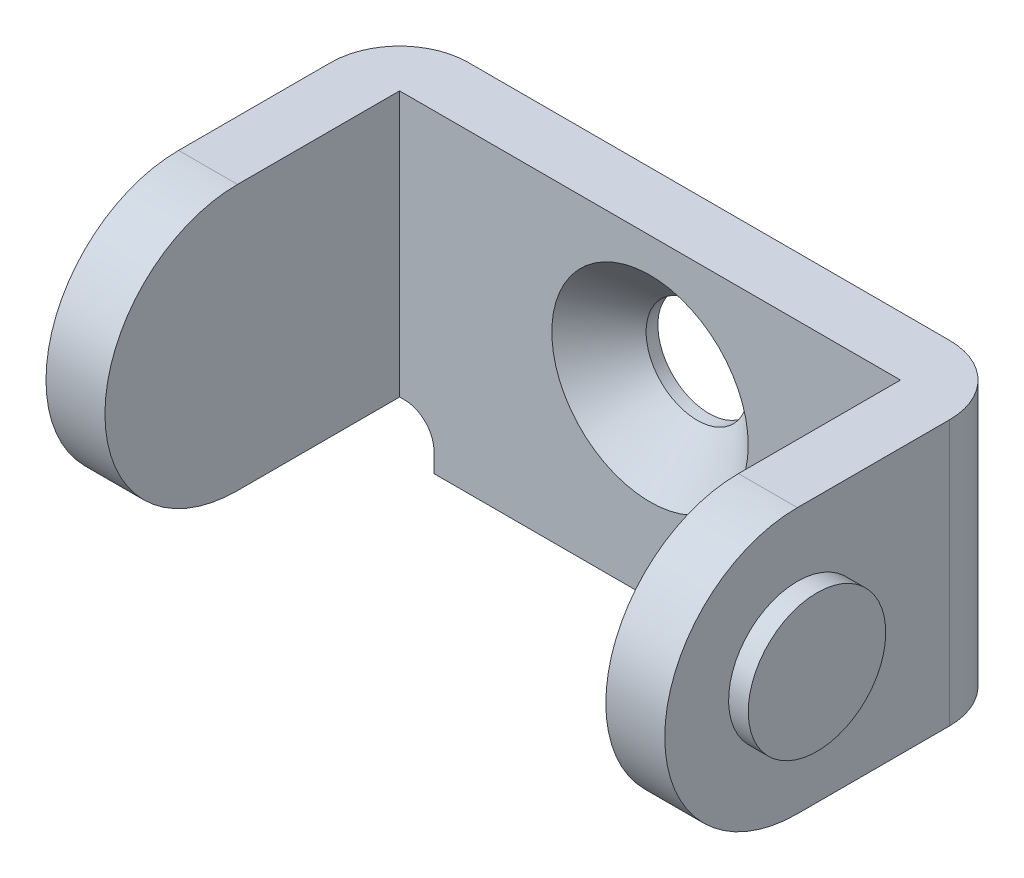
ISO-10303-21;
HEADER;
FILE_DESCRIPTION(('STEP AP214'),'2;1');
FILE_NAME('part.step','',(''),(''),'','','');
FILE_SCHEMA(('AUTOMOTIVE_DESIGN { 1 0 10303 214 1 1 1 1 }'));
ENDSEC;
DATA;
#1=APPLICATION_CONTEXT('core data for automotive mechanical design processes');
#2=APPLICATION_PROTOCOL_DEFINITION('international standard','automotive_design',2000,#1);
#3=PRODUCT_CONTEXT('',#1,'mechanical');
#4=PRODUCT('Part','Part','',(#3));
#5=PRODUCT_RELATED_PRODUCT_CATEGORY('part','',(#4));
#6=PRODUCT_DEFINITION_FORMATION('','',#4);
#7=PRODUCT_DEFINITION_CONTEXT('part definition',#1,'design');
#8=PRODUCT_DEFINITION('design','',#6,#7);
#9=PRODUCT_DEFINITION_SHAPE('','',#8);
#10=(LENGTH_UNIT() NAMED_UNIT(*) SI_UNIT(.MILLI.,.METRE.));
#11=(NAMED_UNIT(*) PLANE_ANGLE_UNIT() SI_UNIT($,.RADIAN.));
#12=(NAMED_UNIT(*) SI_UNIT($,.STERADIAN.) SOLID_ANGLE_UNIT());
#13=UNCERTAINTY_MEASURE_WITH_UNIT(LENGTH_MEASURE(1.E-05),#10,'distance_accuracy_value','');
#14=(GEOMETRIC_REPRESENTATION_CONTEXT(3) GLOBAL_UNCERTAINTY_ASSIGNED_CONTEXT((#13)) GLOBAL_UNIT_ASSIGNED_CONTEXT((#10,
#11,#12)) REPRESENTATION_CONTEXT('',''));
#15=CARTESIAN_POINT('',(0.,0.,0.));
#16=DIRECTION('',(0.,0.,1.));
#17=DIRECTION('',(1.,0.,0.));
#18=AXIS2_PLACEMENT_3D('',#15,#16,#17);
#19=CARTESIAN_POINT('',(-16.75,-6.74999999999999,11.25));
#20=DIRECTION('',(-1.,0.,0.));
#21=DIRECTION('',(0.,-1.,0.));
#22=AXIS2_PLACEMENT_3D('',#19,#20,#21);
#23=PLANE('',#22);
#24=CARTESIAN_POINT('',(-16.75,-6.74999999999999,11.25));
#25=DIRECTION('',(-1.,0.,0.));
#26=DIRECTION('',(0.,-1.,0.));
#27=AXIS2_PLACEMENT_3D('',#24,#25,#26);
#28=CIRCLE('',#27,3.5);
#29=CARTESIAN_POINT('',(-16.75,-10.25,11.25));
#30=VERTEX_POINT('',#29);
#31=EDGE_CURVE('E401',#30,#30,#28,.F.);
#32=ORIENTED_EDGE('',*,*,#31,.F.);
#33=EDGE_LOOP('',(#32));
#34=FACE_BOUND('',#33,.T.);
#35=ADVANCED_FACE('F35',(#34),#23,.T.);
#36=CARTESIAN_POINT('',(16.75,-6.74999999999999,11.25));
#37=DIRECTION('',(1.,0.,0.));
#38=DIRECTION('',(0.,1.,0.));
#39=AXIS2_PLACEMENT_3D('',#36,#37,#38);
#40=PLANE('',#39);
#41=CARTESIAN_POINT('',(16.75,-6.74999999999999,11.25));
#42=DIRECTION('',(1.,0.,0.));
#43=DIRECTION('',(0.,1.,0.));
#44=AXIS2_PLACEMENT_3D('',#41,#42,#43);
#45=CIRCLE('',#44,3.5);
#46=CARTESIAN_POINT('',(16.75,-3.24999999999999,11.25));
#47=VERTEX_POINT('',#46);
#48=EDGE_CURVE('E398',#47,#47,#45,.F.);
#49=ORIENTED_EDGE('',*,*,#48,.F.);
#50=EDGE_LOOP('',(#49));
#51=FACE_BOUND('',#50,.T.);
#52=ADVANCED_FACE('F325',(#51),#40,.T.);
#53=CARTESIAN_POINT('',(-15.75,-6.74999999999999,11.25));
#54=DIRECTION('',(-1.,0.,0.));
#55=DIRECTION('',(0.,-1.,0.));
#56=AXIS2_PLACEMENT_3D('',#53,#54,#55);
#57=CYLINDRICAL_SURFACE('',#56,3.5);
#58=ORIENTED_EDGE('',*,*,#31,.T.);
#59=EDGE_LOOP('',(#58));
#60=FACE_BOUND('',#59,.T.);
#61=CARTESIAN_POINT('',(-15.75,-6.74999999999999,11.25));
#62=DIRECTION('',(-1.,0.,0.));
#63=DIRECTION('',(0.,-1.,0.));
#64=AXIS2_PLACEMENT_3D('',#61,#62,#63);
#65=CIRCLE('',#64,3.5);
#66=CARTESIAN_POINT('',(-15.75,-10.25,11.25));
#67=VERTEX_POINT('',#66);
#68=EDGE_CURVE('E395',#67,#67,#65,.F.);
#69=ORIENTED_EDGE('',*,*,#68,.F.);
#70=EDGE_LOOP('',(#69));
#71=FACE_BOUND('',#70,.T.);
#72=ADVANCED_FACE('F329',(#60,#71),#57,.T.);
#73=CARTESIAN_POINT('',(15.75,-6.74999999999999,11.25));
#74=DIRECTION('',(1.,0.,0.));
#75=DIRECTION('',(0.,1.,0.));
#76=AXIS2_PLACEMENT_3D('',#73,#74,#75);
#77=CYLINDRICAL_SURFACE('',#76,3.5);
#78=ORIENTED_EDGE('',*,*,#48,.T.);
#79=EDGE_LOOP('',(#78));
#80=FACE_BOUND('',#79,.T.);
#81=CARTESIAN_POINT('',(15.75,-6.74999999999999,11.25));
#82=DIRECTION('',(1.,0.,0.));
#83=DIRECTION('',(0.,1.,0.));
#84=AXIS2_PLACEMENT_3D('',#81,#82,#83);
#85=CIRCLE('',#84,3.5);
#86=CARTESIAN_POINT('',(15.75,-3.24999999999999,11.25));
#87=VERTEX_POINT('',#86);
#88=EDGE_CURVE('E385',#87,#87,#85,.F.);
#89=ORIENTED_EDGE('',*,*,#88,.F.);
#90=EDGE_LOOP('',(#89));
#91=FACE_BOUND('',#90,.T.);
#92=ADVANCED_FACE('F333',(#80,#91),#77,.T.);
#93=CARTESIAN_POINT('',(-15.75,-13.5,0.));
#94=DIRECTION('',(-1.,0.,0.));
#95=DIRECTION('',(0.,-1.,0.));
#96=AXIS2_PLACEMENT_3D('',#93,#94,#95);
#97=PLANE('',#96);
#98=ORIENTED_EDGE('',*,*,#68,.T.);
#99=EDGE_LOOP('',(#98));
#100=FACE_BOUND('',#99,.T.);
#101=CARTESIAN_POINT('',(-15.75,-6.74999999999998,11.25));
#102=DIRECTION('',(1.,0.,0.));
#103=DIRECTION('',(0.,0.,-1.));
#104=AXIS2_PLACEMENT_3D('',#101,#102,#103);
#105=CIRCLE('',#104,6.75000000000002);
#106=CARTESIAN_POINT('',(-15.75,0.,11.25));
#107=VERTEX_POINT('',#106);
#108=CARTESIAN_POINT('',(-15.75,-13.5,11.25));
#109=VERTEX_POINT('',#108);
#110=EDGE_CURVE('E393',#107,#109,#105,.T.);
#111=ORIENTED_EDGE('',*,*,#110,.F.);
#112=DIRECTION('',(0.,0.,1.));
#113=VECTOR('',#112,1.);
#114=CARTESIAN_POINT('',(-15.75,0.,0.));
#115=LINE('',#114,#113);
#116=CARTESIAN_POINT('',(-15.75,0.,3.5));
#117=VERTEX_POINT('',#116);
#118=EDGE_CURVE('E210',#117,#107,#115,.T.);
#119=ORIENTED_EDGE('',*,*,#118,.F.);
#120=DIRECTION('',(0.,1.,0.));
#121=VECTOR('',#120,1.);
#122=CARTESIAN_POINT('',(-15.75,-17.1841485679075,3.5));
#123=LINE('',#122,#121);
#124=CARTESIAN_POINT('',(-15.75,-13.5,3.5));
#125=VERTEX_POINT('',#124);
#126=EDGE_CURVE('E245',#125,#117,#123,.T.);
#127=ORIENTED_EDGE('',*,*,#126,.F.);
#128=DIRECTION('',(0.,0.,1.));
#129=VECTOR('',#128,1.);
#130=CARTESIAN_POINT('',(-15.75,-13.5,0.));
#131=LINE('',#130,#129);
#132=EDGE_CURVE('E163',#109,#125,#131,.F.);
#133=ORIENTED_EDGE('',*,*,#132,.F.);
#134=EDGE_LOOP('',(#111,#119,#127,#133));
#135=FACE_BOUND('',#134,.T.);
#136=ADVANCED_FACE('F321',(#100,#135),#97,.T.);
#137=CARTESIAN_POINT('',(-15.7500000000001,-6.74999999999998,11.25));
#138=DIRECTION('',(1.,0.,0.));
#139=DIRECTION('',(0.,0.,-1.));
#140=AXIS2_PLACEMENT_3D('',#137,#138,#139);
#141=CYLINDRICAL_SURFACE('',#140,6.75000000000002);
#142=ORIENTED_EDGE('',*,*,#110,.T.);
#143=DIRECTION('',(1.,0.,0.));
#144=VECTOR('',#143,1.);
#145=CARTESIAN_POINT('',(-11.,-13.5,11.25));
#146=LINE('',#145,#144);
#147=CARTESIAN_POINT('',(-12.75,-13.5,11.25));
#148=VERTEX_POINT('',#147);
#149=EDGE_CURVE('E220',#148,#109,#146,.F.);
#150=ORIENTED_EDGE('',*,*,#149,.F.);
#151=CARTESIAN_POINT('',(-12.75,-6.74999999999998,11.25));
#152=DIRECTION('',(1.,0.,0.));
#153=DIRECTION('',(0.,0.,-1.));
#154=AXIS2_PLACEMENT_3D('',#151,#152,#153);
#155=CIRCLE('',#154,6.75000000000002);
#156=CARTESIAN_POINT('',(-12.75,0.,11.25));
#157=VERTEX_POINT('',#156);
#158=EDGE_CURVE('E391',#157,#148,#155,.T.);
#159=ORIENTED_EDGE('',*,*,#158,.F.);
#160=DIRECTION('',(-1.,0.,0.));
#161=VECTOR('',#160,1.);
#162=CARTESIAN_POINT('',(-15.75,0.,11.25));
#163=LINE('',#162,#161);
#164=EDGE_CURVE('E209',#107,#157,#163,.F.);
#165=ORIENTED_EDGE('',*,*,#164,.F.);
#166=EDGE_LOOP('',(#142,#150,#159,#165));
#167=FACE_BOUND('',#166,.T.);
#168=ADVANCED_FACE('F317',(#167),#141,.T.);
#169=CARTESIAN_POINT('',(-12.75,0.,3.));
#170=DIRECTION('',(1.,0.,0.));
#171=DIRECTION('',(0.,1.,0.));
#172=AXIS2_PLACEMENT_3D('',#169,#170,#171);
#173=PLANE('',#172);
#174=ORIENTED_EDGE('',*,*,#158,.T.);
#175=DIRECTION('',(0.,0.,1.));
#176=VECTOR('',#175,1.);
#177=CARTESIAN_POINT('',(-12.75,-13.5,0.));
#178=LINE('',#177,#176);
#179=CARTESIAN_POINT('',(-12.75,-13.5,3.));
#180=VERTEX_POINT('',#179);
#181=EDGE_CURVE('E224',#180,#148,#178,.T.);
#182=ORIENTED_EDGE('',*,*,#181,.F.);
#183=DIRECTION('',(0.,1.,0.));
#184=VECTOR('',#183,1.);
#185=CARTESIAN_POINT('',(-12.75,-71.7267259098514,3.));
#186=LINE('',#185,#184);
#187=CARTESIAN_POINT('',(-12.75,0.,3.));
#188=VERTEX_POINT('',#187);
#189=EDGE_CURVE('E409',#180,#188,#186,.T.);
#190=ORIENTED_EDGE('',*,*,#189,.T.);
#191=DIRECTION('',(0.,0.,1.));
#192=VECTOR('',#191,1.);
#193=CARTESIAN_POINT('',(-12.75,0.,0.));
#194=LINE('',#193,#192);
#195=EDGE_CURVE('E207',#157,#188,#194,.F.);
#196=ORIENTED_EDGE('',*,*,#195,.F.);
#197=EDGE_LOOP('',(#174,#182,#190,#196));
#198=FACE_BOUND('',#197,.T.);
#199=ADVANCED_FACE('F320',(#198),#173,.T.);
#200=CARTESIAN_POINT('',(12.75,-13.5,3.));
#201=DIRECTION('',(-1.,0.,0.));
#202=DIRECTION('',(0.,-1.,0.));
#203=AXIS2_PLACEMENT_3D('',#200,#201,#202);
#204=PLANE('',#203);
#205=CARTESIAN_POINT('',(12.75,-6.74999999999999,11.25));
#206=DIRECTION('',(1.,0.,0.));
#207=DIRECTION('',(0.,0.,-1.));
#208=AXIS2_PLACEMENT_3D('',#205,#206,#207);
#209=CIRCLE('',#208,6.75000000000001);
#210=CARTESIAN_POINT('',(12.75,0.,11.25));
#211=VERTEX_POINT('',#210);
#212=CARTESIAN_POINT('',(12.75,-13.5,11.25));
#213=VERTEX_POINT('',#212);
#214=EDGE_CURVE('E388',#211,#213,#209,.T.);
#215=ORIENTED_EDGE('',*,*,#214,.F.);
#216=DIRECTION('',(0.,0.,1.));
#217=VECTOR('',#216,1.);
#218=CARTESIAN_POINT('',(12.75,0.,0.));
#219=LINE('',#218,#217);
#220=CARTESIAN_POINT('',(12.75,0.,3.));
#221=VERTEX_POINT('',#220);
#222=EDGE_CURVE('E201',#221,#211,#219,.T.);
#223=ORIENTED_EDGE('',*,*,#222,.F.);
#224=DIRECTION('',(0.,1.,0.));
#225=VECTOR('',#224,1.);
#226=CARTESIAN_POINT('',(12.75,-71.7267259098514,3.));
#227=LINE('',#226,#225);
#228=CARTESIAN_POINT('',(12.75,-13.5,3.));
#229=VERTEX_POINT('',#228);
#230=EDGE_CURVE('E410',#229,#221,#227,.T.);
#231=ORIENTED_EDGE('',*,*,#230,.F.);
#232=DIRECTION('',(0.,0.,1.));
#233=VECTOR('',#232,1.);
#234=CARTESIAN_POINT('',(12.75,-13.5,0.));
#235=LINE('',#234,#233);
#236=EDGE_CURVE('E227',#213,#229,#235,.F.);
#237=ORIENTED_EDGE('',*,*,#236,.F.);
#238=EDGE_LOOP('',(#215,#223,#231,#237));
#239=FACE_BOUND('',#238,.T.);
#240=ADVANCED_FACE('F315',(#239),#204,.T.);
#241=CARTESIAN_POINT('',(12.75,-6.74999999999999,11.25));
#242=DIRECTION('',(1.,0.,0.));
#243=DIRECTION('',(0.,0.,-1.));
#244=AXIS2_PLACEMENT_3D('',#241,#242,#243);
#245=CYLINDRICAL_SURFACE('',#244,6.75000000000001);
#246=ORIENTED_EDGE('',*,*,#214,.T.);
#247=DIRECTION('',(1.,0.,0.));
#248=VECTOR('',#247,1.);
#249=CARTESIAN_POINT('',(15.75,-13.5,11.25));
#250=LINE('',#249,#248);
#251=CARTESIAN_POINT('',(15.75,-13.5,11.25));
#252=VERTEX_POINT('',#251);
#253=EDGE_CURVE('E164',#252,#213,#250,.F.);
#254=ORIENTED_EDGE('',*,*,#253,.F.);
#255=CARTESIAN_POINT('',(15.75,-6.74999999999999,11.25));
#256=DIRECTION('',(1.,0.,0.));
#257=DIRECTION('',(0.,0.,-1.));
#258=AXIS2_PLACEMENT_3D('',#255,#256,#257);
#259=CIRCLE('',#258,6.75000000000001);
#260=CARTESIAN_POINT('',(15.75,0.,11.25));
#261=VERTEX_POINT('',#260);
#262=EDGE_CURVE('E230',#261,#252,#259,.T.);
#263=ORIENTED_EDGE('',*,*,#262,.F.);
#264=DIRECTION('',(-1.,0.,0.));
#265=VECTOR('',#264,1.);
#266=CARTESIAN_POINT('',(-15.75,0.,11.25));
#267=LINE('',#266,#265);
#268=EDGE_CURVE('E200',#211,#261,#267,.F.);
#269=ORIENTED_EDGE('',*,*,#268,.F.);
#270=EDGE_LOOP('',(#246,#254,#263,#269));
#271=FACE_BOUND('',#270,.T.);
#272=ADVANCED_FACE('F311',(#271),#245,.T.);
#273=CARTESIAN_POINT('',(15.75,0.,0.));
#274=DIRECTION('',(1.,0.,0.));
#275=DIRECTION('',(0.,1.,0.));
#276=AXIS2_PLACEMENT_3D('',#273,#274,#275);
#277=PLANE('',#276);
#278=ORIENTED_EDGE('',*,*,#88,.T.);
#279=EDGE_LOOP('',(#278));
#280=FACE_BOUND('',#279,.T.);
#281=ORIENTED_EDGE('',*,*,#262,.T.);
#282=DIRECTION('',(0.,0.,1.));
#283=VECTOR('',#282,1.);
#284=CARTESIAN_POINT('',(15.75,-13.5,0.));
#285=LINE('',#284,#283);
#286=CARTESIAN_POINT('',(15.75,-13.5,3.5));
#287=VERTEX_POINT('',#286);
#288=EDGE_CURVE('E229',#287,#252,#285,.T.);
#289=ORIENTED_EDGE('',*,*,#288,.F.);
#290=DIRECTION('',(0.,-1.,0.));
#291=VECTOR('',#290,1.);
#292=CARTESIAN_POINT('',(15.75,-10.4341485679075,3.5));
#293=LINE('',#292,#291);
#294=CARTESIAN_POINT('',(15.75,0.,3.5));
#295=VERTEX_POINT('',#294);
#296=EDGE_CURVE('E238',#295,#287,#293,.T.);
#297=ORIENTED_EDGE('',*,*,#296,.F.);
#298=DIRECTION('',(0.,0.,1.));
#299=VECTOR('',#298,1.);
#300=CARTESIAN_POINT('',(15.75,0.,0.));
#301=LINE('',#300,#299);
#302=EDGE_CURVE('E197',#261,#295,#301,.F.);
#303=ORIENTED_EDGE('',*,*,#302,.F.);
#304=EDGE_LOOP('',(#281,#289,#297,#303));
#305=FACE_BOUND('',#304,.T.);
#306=ADVANCED_FACE('F314',(#280,#305),#277,.T.);
#307=CARTESIAN_POINT('',(15.75,-13.5,0.));
#308=DIRECTION('',(0.,-1.,0.));
#309=DIRECTION('',(1.,0.,0.));
#310=AXIS2_PLACEMENT_3D('',#307,#308,#309);
#311=PLANE('',#310);
#312=ORIENTED_EDGE('',*,*,#236,.T.);
#313=DIRECTION('',(1.,0.,0.));
#314=VECTOR('',#313,1.);
#315=CARTESIAN_POINT('',(15.75,-13.5,3.));
#316=LINE('',#315,#314);
#317=CARTESIAN_POINT('',(12.5,-13.5,3.));
#318=VERTEX_POINT('',#317);
#319=EDGE_CURVE('E404',#318,#229,#316,.T.);
#320=ORIENTED_EDGE('',*,*,#319,.F.);
#321=DIRECTION('',(0.,0.,1.));
#322=VECTOR('',#321,1.);
#323=CARTESIAN_POINT('',(12.5,-13.5,1.53349364905391));
#324=LINE('',#323,#322);
#325=CARTESIAN_POINT('',(12.5,-13.5,0.00893998905776507));
#326=VERTEX_POINT('',#325);
#327=EDGE_CURVE('E233',#326,#318,#324,.T.);
#328=ORIENTED_EDGE('',*,*,#327,.F.);
#329=CARTESIAN_POINT('',(12.25,-13.5,3.5));
#330=DIRECTION('',(0.,-1.,0.));
#331=DIRECTION('',(0.,0.,-1.));
#332=AXIS2_PLACEMENT_3D('',#329,#330,#331);
#333=CIRCLE('',#332,3.5);
#334=EDGE_CURVE('E237',#287,#326,#333,.F.);
#335=ORIENTED_EDGE('',*,*,#334,.F.);
#336=ORIENTED_EDGE('',*,*,#288,.T.);
#337=ORIENTED_EDGE('',*,*,#253,.T.);
#338=EDGE_LOOP('',(#312,#320,#328,#335,#336,#337));
#339=FACE_BOUND('',#338,.T.);
#340=ADVANCED_FACE('F349',(#339),#311,.T.);
#341=CARTESIAN_POINT('',(11.,-13.5,0.));
#342=DIRECTION('',(1.,0.,0.));
#343=DIRECTION('',(0.,1.,0.));
#344=AXIS2_PLACEMENT_3D('',#341,#342,#343);
#345=PLANE('',#344);
#346=DIRECTION('',(0.,0.,-1.));
#347=VECTOR('',#346,1.);
#348=CARTESIAN_POINT('',(11.,-15.,1.53349364905391));
#349=LINE('',#348,#347);
#350=CARTESIAN_POINT('',(11.,-15.,3.));
#351=VERTEX_POINT('',#350);
#352=CARTESIAN_POINT('',(11.,-15.,0.));
#353=VERTEX_POINT('',#352);
#354=EDGE_CURVE('E174',#351,#353,#349,.T.);
#355=ORIENTED_EDGE('',*,*,#354,.F.);
#356=DIRECTION('',(0.,1.,0.));
#357=VECTOR('',#356,1.);
#358=CARTESIAN_POINT('',(11.,-20.8682971358151,3.));
#359=LINE('',#358,#357);
#360=CARTESIAN_POINT('',(11.,-16.,3.));
#361=VERTEX_POINT('',#360);
#362=EDGE_CURVE('E168',#361,#351,#359,.T.);
#363=ORIENTED_EDGE('',*,*,#362,.F.);
#364=DIRECTION('',(0.,0.,1.));
#365=VECTOR('',#364,1.);
#366=CARTESIAN_POINT('',(11.,-16.,1.5));
#367=LINE('',#366,#365);
#368=CARTESIAN_POINT('',(11.,-16.,0.));
#369=VERTEX_POINT('',#368);
#370=EDGE_CURVE('E151',#369,#361,#367,.T.);
#371=ORIENTED_EDGE('',*,*,#370,.F.);
#372=DIRECTION('',(0.,1.,0.));
#373=VECTOR('',#372,1.);
#374=CARTESIAN_POINT('',(11.,-13.5,0.));
#375=LINE('',#374,#373);
#376=EDGE_CURVE('E156',#369,#353,#375,.T.);
#377=ORIENTED_EDGE('',*,*,#376,.T.);
#378=EDGE_LOOP('',(#355,#363,#371,#377));
#379=FACE_BOUND('',#378,.T.);
#380=ADVANCED_FACE('F167',(#379),#345,.T.);
#381=CARTESIAN_POINT('',(-11.,-13.5,0.));
#382=DIRECTION('',(0.,-1.,0.));
#383=DIRECTION('',(1.,0.,0.));
#384=AXIS2_PLACEMENT_3D('',#381,#382,#383);
#385=PLANE('',#384);
#386=DIRECTION('',(1.,0.,0.));
#387=VECTOR('',#386,1.);
#388=CARTESIAN_POINT('',(-11.,-13.5,3.));
#389=LINE('',#388,#387);
#390=CARTESIAN_POINT('',(-12.5,-13.5,3.));
#391=VERTEX_POINT('',#390);
#392=EDGE_CURVE('E407',#180,#391,#389,.T.);
#393=ORIENTED_EDGE('',*,*,#392,.F.);
#394=ORIENTED_EDGE('',*,*,#181,.T.);
#395=ORIENTED_EDGE('',*,*,#149,.T.);
#396=ORIENTED_EDGE('',*,*,#132,.T.);
#397=CARTESIAN_POINT('',(-12.25,-13.5,3.5));
#398=DIRECTION('',(0.,1.,0.));
#399=DIRECTION('',(-1.,0.,0.));
#400=AXIS2_PLACEMENT_3D('',#397,#398,#399);
#401=CIRCLE('',#400,3.5);
#402=CARTESIAN_POINT('',(-12.5,-13.5,0.0089399890577643));
#403=VERTEX_POINT('',#402);
#404=EDGE_CURVE('E247',#403,#125,#401,.T.);
#405=ORIENTED_EDGE('',*,*,#404,.F.);
#406=DIRECTION('',(0.,0.,-1.));
#407=VECTOR('',#406,1.);
#408=CARTESIAN_POINT('',(-12.5,-13.5,1.5334936490539));
#409=LINE('',#408,#407);
#410=EDGE_CURVE('E221',#391,#403,#409,.T.);
#411=ORIENTED_EDGE('',*,*,#410,.F.);
#412=EDGE_LOOP('',(#393,#394,#395,#396,#405,#411));
#413=FACE_BOUND('',#412,.T.);
#414=ADVANCED_FACE('F356',(#413),#385,.T.);
#415=CARTESIAN_POINT('',(-11.,-17.5,0.));
#416=DIRECTION('',(-1.,0.,0.));
#417=DIRECTION('',(0.,-1.,0.));
#418=AXIS2_PLACEMENT_3D('',#415,#416,#417);
#419=PLANE('',#418);
#420=DIRECTION('',(0.,0.,1.));
#421=VECTOR('',#420,1.);
#422=CARTESIAN_POINT('',(-11.,-15.,1.5334936490539));
#423=LINE('',#422,#421);
#424=CARTESIAN_POINT('',(-11.,-15.,0.));
#425=VERTEX_POINT('',#424);
#426=CARTESIAN_POINT('',(-11.,-15.,3.));
#427=VERTEX_POINT('',#426);
#428=EDGE_CURVE('E171',#425,#427,#423,.T.);
#429=ORIENTED_EDGE('',*,*,#428,.F.);
#430=DIRECTION('',(0.,-1.,0.));
#431=VECTOR('',#430,1.);
#432=CARTESIAN_POINT('',(-11.,-17.5,0.));
#433=LINE('',#432,#431);
#434=CARTESIAN_POINT('',(-11.,-16.,0.));
#435=VERTEX_POINT('',#434);
#436=EDGE_CURVE('E58',#425,#435,#433,.T.);
#437=ORIENTED_EDGE('',*,*,#436,.T.);
#438=DIRECTION('',(0.,0.,-1.));
#439=VECTOR('',#438,1.);
#440=CARTESIAN_POINT('',(-11.,-16.,1.5));
#441=LINE('',#440,#439);
#442=CARTESIAN_POINT('',(-11.,-16.,3.));
#443=VERTEX_POINT('',#442);
#444=EDGE_CURVE('E154',#443,#435,#441,.T.);
#445=ORIENTED_EDGE('',*,*,#444,.F.);
#446=DIRECTION('',(0.,1.,0.));
#447=VECTOR('',#446,1.);
#448=CARTESIAN_POINT('',(-11.,-20.8682971358151,3.));
#449=LINE('',#448,#447);
#450=EDGE_CURVE('E216',#427,#443,#449,.F.);
#451=ORIENTED_EDGE('',*,*,#450,.F.);
#452=EDGE_LOOP('',(#429,#437,#445,#451));
#453=FACE_BOUND('',#452,.T.);
#454=ADVANCED_FACE('F358',(#453),#419,.T.);
#455=CARTESIAN_POINT('',(0.,-20.8682971358151,3.));
#456=DIRECTION('',(0.,0.,1.));
#457=DIRECTION('',(1.,0.,0.));
#458=AXIS2_PLACEMENT_3D('',#455,#456,#457);
#459=PLANE('',#458);
#460=DIRECTION('',(1.,0.,0.));
#461=VECTOR('',#460,1.);
#462=CARTESIAN_POINT('',(20.,-16.,3.));
#463=LINE('',#462,#461);
#464=EDGE_CURVE('E413',#443,#361,#463,.T.);
#465=ORIENTED_EDGE('',*,*,#464,.T.);
#466=ORIENTED_EDGE('',*,*,#362,.T.);
#467=CARTESIAN_POINT('',(12.5,-15.,3.));
#468=DIRECTION('',(0.,0.,1.));
#469=DIRECTION('',(1.,0.,0.));
#470=AXIS2_PLACEMENT_3D('',#467,#468,#469);
#471=CIRCLE('',#470,1.49999999999997);
#472=EDGE_CURVE('E236',#318,#351,#471,.T.);
#473=ORIENTED_EDGE('',*,*,#472,.F.);
#474=ORIENTED_EDGE('',*,*,#319,.T.);
#475=ORIENTED_EDGE('',*,*,#230,.T.);
#476=DIRECTION('',(-1.,0.,0.));
#477=VECTOR('',#476,1.);
#478=CARTESIAN_POINT('',(-15.75,0.,3.));
#479=LINE('',#478,#477);
#480=EDGE_CURVE('E204',#188,#221,#479,.F.);
#481=ORIENTED_EDGE('',*,*,#480,.F.);
#482=ORIENTED_EDGE('',*,*,#189,.F.);
#483=ORIENTED_EDGE('',*,*,#392,.T.);
#484=CARTESIAN_POINT('',(-12.5,-15.,3.));
#485=DIRECTION('',(0.,0.,1.));
#486=DIRECTION('',(1.,0.,0.));
#487=AXIS2_PLACEMENT_3D('',#484,#485,#486);
#488=CIRCLE('',#487,1.49999999999997);
#489=EDGE_CURVE('E50',#427,#391,#488,.T.);
#490=ORIENTED_EDGE('',*,*,#489,.F.);
#491=ORIENTED_EDGE('',*,*,#450,.T.);
#492=EDGE_LOOP('',(#465,#466,#473,#474,#475,#481,#482,#483,#490,#491));
#493=FACE_BOUND('',#492,.T.);
#494=CARTESIAN_POINT('',(0.,-6.75,3.));
#495=DIRECTION('',(0.,0.,1.));
#496=DIRECTION('',(1.,0.,0.));
#497=AXIS2_PLACEMENT_3D('',#494,#495,#496);
#498=CIRCLE('',#497,5.);
#499=CARTESIAN_POINT('',(5.,-6.75,3.));
#500=VERTEX_POINT('',#499);
#501=EDGE_CURVE('E215',#500,#500,#498,.T.);
#502=ORIENTED_EDGE('',*,*,#501,.F.);
#503=EDGE_LOOP('',(#502));
#504=FACE_BOUND('',#503,.T.);
#505=ADVANCED_FACE('F279',(#493,#504),#459,.T.);
#506=CARTESIAN_POINT('',(0.,-6.75,0.599999999999998));
#507=DIRECTION('',(0.,0.,1.));
#508=DIRECTION('',(1.,0.,0.));
#509=AXIS2_PLACEMENT_3D('',#506,#507,#508);
#510=CONICAL_SURFACE('',#509,2.6,0.785398163397448);
#511=CARTESIAN_POINT('',(0.,-6.75,0.600000000000001));
#512=DIRECTION('',(0.,0.,1.));
#513=DIRECTION('',(1.,0.,0.));
#514=AXIS2_PLACEMENT_3D('',#511,#512,#513);
#515=CIRCLE('',#514,2.6);
#516=CARTESIAN_POINT('',(2.6,-6.75,0.600000000000001));
#517=VERTEX_POINT('',#516);
#518=EDGE_CURVE('E182',#517,#517,#515,.T.);
#519=ORIENTED_EDGE('',*,*,#518,.F.);
#520=EDGE_LOOP('',(#519));
#521=FACE_BOUND('',#520,.T.);
#522=ORIENTED_EDGE('',*,*,#501,.T.);
#523=EDGE_LOOP('',(#522));
#524=FACE_BOUND('',#523,.T.);
#525=ADVANCED_FACE('F277',(#521,#524),#510,.F.);
#526=CARTESIAN_POINT('',(-12.25,-17.1841485679075,3.5));
#527=DIRECTION('',(0.,1.,0.));
#528=DIRECTION('',(-1.,0.,0.));
#529=AXIS2_PLACEMENT_3D('',#526,#527,#528);
#530=CYLINDRICAL_SURFACE('',#529,3.5);
#531=ORIENTED_EDGE('',*,*,#404,.T.);
#532=ORIENTED_EDGE('',*,*,#126,.T.);
#533=CARTESIAN_POINT('',(-12.25,0.,3.5));
#534=DIRECTION('',(0.,1.,0.));
#535=DIRECTION('',(-1.,0.,0.));
#536=AXIS2_PLACEMENT_3D('',#533,#534,#535);
#537=CIRCLE('',#536,3.5);
#538=CARTESIAN_POINT('',(-12.25,0.,0.));
#539=VERTEX_POINT('',#538);
#540=EDGE_CURVE('E213',#539,#117,#537,.T.);
#541=ORIENTED_EDGE('',*,*,#540,.F.);
#542=DIRECTION('',(0.,1.,0.));
#543=VECTOR('',#542,1.);
#544=CARTESIAN_POINT('',(-12.25,-20.8682971358151,0.));
#545=LINE('',#544,#543);
#546=CARTESIAN_POINT('',(-12.25,-13.5209800542251,0.));
#547=VERTEX_POINT('',#546);
#548=EDGE_CURVE('E187',#547,#539,#545,.T.);
#549=ORIENTED_EDGE('',*,*,#548,.F.);
#550=CARTESIAN_POINT('',(-12.5,-13.5,0.00893998905776461));
#551=CARTESIAN_POINT('',(-12.4580936705665,-13.500001666333,0.00595001207323805));
#552=CARTESIAN_POINT('',(-12.4163071725169,-13.5017508373515,0.00371002449282756));
#553=CARTESIAN_POINT('',(-12.3329738391836,-13.5087441887597,0.000730028140159599));
#554=CARTESIAN_POINT('',(-12.2914270038998,-13.5139883691496,-9.98063201823311E-06));
#555=CARTESIAN_POINT('',(-12.25,-13.5209800542251,0.));
#556=B_SPLINE_CURVE_WITH_KNOTS('',3,(#550,#551,#552,#553,#554,#555),.UNSPECIFIED.,.F.,.F.,(4,2,
4),(0.,0.125649102924411,0.251298205855494),.UNSPECIFIED.);
#557=EDGE_CURVE('E186',#403,#547,#556,.T.);
#558=ORIENTED_EDGE('',*,*,#557,.F.);
#559=EDGE_LOOP('',(#531,#532,#541,#549,#558));
#560=FACE_BOUND('',#559,.T.);
#561=ADVANCED_FACE('F271',(#560),#530,.T.);
#562=CARTESIAN_POINT('',(-15.75,0.,0.));
#563=DIRECTION('',(0.,1.,0.));
#564=DIRECTION('',(-1.,0.,0.));
#565=AXIS2_PLACEMENT_3D('',#562,#563,#564);
#566=PLANE('',#565);
#567=ORIENTED_EDGE('',*,*,#480,.T.);
#568=ORIENTED_EDGE('',*,*,#222,.T.);
#569=ORIENTED_EDGE('',*,*,#268,.T.);
#570=ORIENTED_EDGE('',*,*,#302,.T.);
#571=CARTESIAN_POINT('',(12.25,0.,3.5));
#572=DIRECTION('',(0.,-1.,0.));
#573=DIRECTION('',(0.,0.,-1.));
#574=AXIS2_PLACEMENT_3D('',#571,#572,#573);
#575=CIRCLE('',#574,3.5);
#576=CARTESIAN_POINT('',(12.25,0.,0.));
#577=VERTEX_POINT('',#576);
#578=EDGE_CURVE('E199',#577,#295,#575,.T.);
#579=ORIENTED_EDGE('',*,*,#578,.F.);
#580=DIRECTION('',(-1.,0.,0.));
#581=VECTOR('',#580,1.);
#582=CARTESIAN_POINT('',(0.,0.,0.));
#583=LINE('',#582,#581);
#584=EDGE_CURVE('E189',#539,#577,#583,.F.);
#585=ORIENTED_EDGE('',*,*,#584,.F.);
#586=ORIENTED_EDGE('',*,*,#540,.T.);
#587=ORIENTED_EDGE('',*,*,#118,.T.);
#588=ORIENTED_EDGE('',*,*,#164,.T.);
#589=ORIENTED_EDGE('',*,*,#195,.T.);
#590=EDGE_LOOP('',(#567,#568,#569,#570,#579,#585,#586,#587,#588,#589));
#591=FACE_BOUND('',#590,.T.);
#592=ADVANCED_FACE('F276',(#591),#566,.T.);
#593=CARTESIAN_POINT('',(12.25,-10.4341485679075,3.5));
#594=DIRECTION('',(0.,-1.,0.));
#595=DIRECTION('',(0.,0.,-1.));
#596=AXIS2_PLACEMENT_3D('',#593,#594,#595);
#597=CYLINDRICAL_SURFACE('',#596,3.5);
#598=CARTESIAN_POINT('',(12.25,-13.5209800542251,0.));
#599=CARTESIAN_POINT('',(12.2914270038998,-13.5139883691496,-9.98063200023736E-06));
#600=CARTESIAN_POINT('',(12.3329738391836,-13.5087441887597,0.00073002814017747));
#601=CARTESIAN_POINT('',(12.4163071725169,-13.5017508373515,0.00371002449281074));
#602=CARTESIAN_POINT('',(12.4580936705665,-13.500001666333,0.00595001207318657));
#603=CARTESIAN_POINT('',(12.5,-13.4999999999999,0.0089399890576612));
#604=B_SPLINE_CURVE_WITH_KNOTS('',3,(#598,#599,#600,#601,#602,#603),.UNSPECIFIED.,.F.,.F.,(4,2,
4),(0.,0.125649102931074,0.251298205855468),.UNSPECIFIED.);
#605=CARTESIAN_POINT('',(12.25,-13.5209800542251,0.));
#606=VERTEX_POINT('',#605);
#607=EDGE_CURVE('E169',#606,#326,#604,.T.);
#608=ORIENTED_EDGE('',*,*,#607,.F.);
#609=DIRECTION('',(0.,1.,0.));
#610=VECTOR('',#609,1.);
#611=CARTESIAN_POINT('',(12.25,-20.8682971358151,0.));
#612=LINE('',#611,#610);
#613=EDGE_CURVE('E191',#577,#606,#612,.F.);
#614=ORIENTED_EDGE('',*,*,#613,.F.);
#615=ORIENTED_EDGE('',*,*,#578,.T.);
#616=ORIENTED_EDGE('',*,*,#296,.T.);
#617=ORIENTED_EDGE('',*,*,#334,.T.);
#618=EDGE_LOOP('',(#608,#614,#615,#616,#617));
#619=FACE_BOUND('',#618,.T.);
#620=ADVANCED_FACE('F282',(#619),#597,.T.);
#621=CARTESIAN_POINT('',(12.5,-15.,0.));
#622=DIRECTION('',(0.,0.,1.));
#623=DIRECTION('',(1.,0.,0.));
#624=AXIS2_PLACEMENT_3D('',#621,#622,#623);
#625=CYLINDRICAL_SURFACE('',#624,1.49999999999997);
#626=ORIENTED_EDGE('',*,*,#327,.T.);
#627=ORIENTED_EDGE('',*,*,#472,.T.);
#628=ORIENTED_EDGE('',*,*,#354,.T.);
#629=CARTESIAN_POINT('',(12.5,-15.,0.));
#630=DIRECTION('',(0.,0.,1.));
#631=DIRECTION('',(1.,0.,0.));
#632=AXIS2_PLACEMENT_3D('',#629,#630,#631);
#633=CIRCLE('',#632,1.49999999999997);
#634=EDGE_CURVE('E43',#606,#353,#633,.T.);
#635=ORIENTED_EDGE('',*,*,#634,.F.);
#636=ORIENTED_EDGE('',*,*,#607,.T.);
#637=EDGE_LOOP('',(#626,#627,#628,#635,#636));
#638=FACE_BOUND('',#637,.T.);
#639=ADVANCED_FACE('F286',(#638),#625,.F.);
#640=CARTESIAN_POINT('',(-12.5,-15.,0.));
#641=DIRECTION('',(0.,0.,1.));
#642=DIRECTION('',(1.,0.,0.));
#643=AXIS2_PLACEMENT_3D('',#640,#641,#642);
#644=CYLINDRICAL_SURFACE('',#643,1.49999999999997);
#645=ORIENTED_EDGE('',*,*,#489,.T.);
#646=ORIENTED_EDGE('',*,*,#410,.T.);
#647=ORIENTED_EDGE('',*,*,#557,.T.);
#648=CARTESIAN_POINT('',(-12.5,-15.,0.));
#649=DIRECTION('',(0.,0.,1.));
#650=DIRECTION('',(1.,0.,0.));
#651=AXIS2_PLACEMENT_3D('',#648,#649,#650);
#652=CIRCLE('',#651,1.49999999999997);
#653=EDGE_CURVE('E190',#425,#547,#652,.T.);
#654=ORIENTED_EDGE('',*,*,#653,.F.);
#655=ORIENTED_EDGE('',*,*,#428,.T.);
#656=EDGE_LOOP('',(#645,#646,#647,#654,#655));
#657=FACE_BOUND('',#656,.T.);
#658=ADVANCED_FACE('F269',(#657),#644,.F.);
#659=CARTESIAN_POINT('',(0.,-6.75,0.));
#660=DIRECTION('',(0.,0.,1.));
#661=DIRECTION('',(1.,0.,0.));
#662=AXIS2_PLACEMENT_3D('',#659,#660,#661);
#663=CYLINDRICAL_SURFACE('',#662,2.6);
#664=CARTESIAN_POINT('',(0.,-6.75,0.));
#665=DIRECTION('',(0.,0.,1.));
#666=DIRECTION('',(1.,0.,0.));
#667=AXIS2_PLACEMENT_3D('',#664,#665,#666);
#668=CIRCLE('',#667,2.6);
#669=CARTESIAN_POINT('',(2.6,-6.75,0.));
#670=VERTEX_POINT('',#669);
#671=EDGE_CURVE('E185',#670,#670,#668,.T.);
#672=ORIENTED_EDGE('',*,*,#671,.F.);
#673=EDGE_LOOP('',(#672));
#674=FACE_BOUND('',#673,.T.);
#675=ORIENTED_EDGE('',*,*,#518,.T.);
#676=EDGE_LOOP('',(#675));
#677=FACE_BOUND('',#676,.T.);
#678=ADVANCED_FACE('F294',(#674,#677),#663,.F.);
#679=CARTESIAN_POINT('',(0.,-20.8682971358151,0.));
#680=DIRECTION('',(0.,0.,-1.));
#681=DIRECTION('',(-1.,0.,0.));
#682=AXIS2_PLACEMENT_3D('',#679,#680,#681);
#683=PLANE('',#682);
#684=DIRECTION('',(1.,0.,0.));
#685=VECTOR('',#684,1.);
#686=CARTESIAN_POINT('',(0.,-16.,0.));
#687=LINE('',#686,#685);
#688=EDGE_CURVE('E12',#435,#369,#687,.T.);
#689=ORIENTED_EDGE('',*,*,#688,.F.);
#690=ORIENTED_EDGE('',*,*,#436,.F.);
#691=ORIENTED_EDGE('',*,*,#653,.T.);
#692=ORIENTED_EDGE('',*,*,#548,.T.);
#693=ORIENTED_EDGE('',*,*,#584,.T.);
#694=ORIENTED_EDGE('',*,*,#613,.T.);
#695=ORIENTED_EDGE('',*,*,#634,.T.);
#696=ORIENTED_EDGE('',*,*,#376,.F.);
#697=EDGE_LOOP('',(#689,#690,#691,#692,#693,#694,#695,#696));
#698=FACE_BOUND('',#697,.T.);
#699=ORIENTED_EDGE('',*,*,#671,.T.);
#700=EDGE_LOOP('',(#699));
#701=FACE_BOUND('',#700,.T.);
#702=ADVANCED_FACE('F37',(#698,#701),#683,.T.);
#703=CARTESIAN_POINT('',(0.,-16.,0.));
#704=DIRECTION('',(0.,1.,0.));
#705=DIRECTION('',(-1.,0.,0.));
#706=AXIS2_PLACEMENT_3D('',#703,#704,#705);
#707=PLANE('',#706);
#708=ORIENTED_EDGE('',*,*,#370,.T.);
#709=ORIENTED_EDGE('',*,*,#464,.F.);
#710=ORIENTED_EDGE('',*,*,#444,.T.);
#711=ORIENTED_EDGE('',*,*,#688,.T.);
#712=EDGE_LOOP('',(#708,#709,#710,#711));
#713=FACE_BOUND('',#712,.T.);
#714=ADVANCED_FACE('F149',(#713),#707,.F.);
#715=CLOSED_SHELL('',(#35,#52,#72,#92,#136,#168,#199,#240,#272,#306,#340,#380,#414,#454,#505,
#525,#561,#592,#620,#639,#658,#678,#702,#714));
#716=MANIFOLD_SOLID_BREP('B2',#715);
#717=ADVANCED_BREP_SHAPE_REPRESENTATION('',(#18,#716),#14);
#718=SHAPE_DEFINITION_REPRESENTATION(#9,#717);
ENDSEC;
END-ISO-10303-21;
